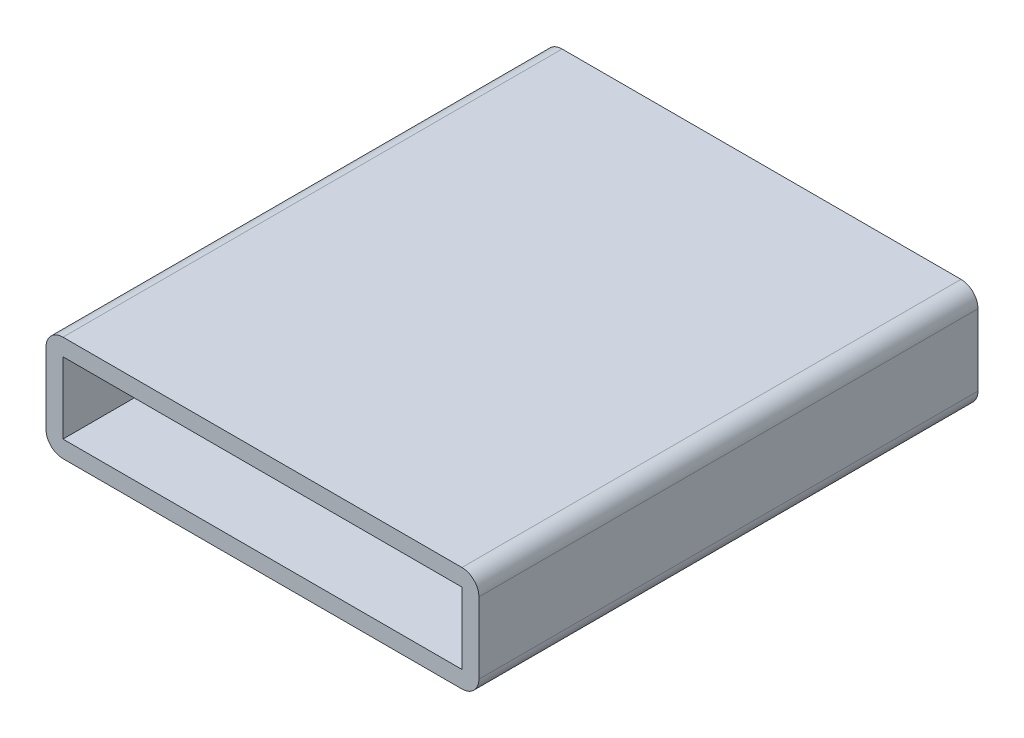
ISO-10303-21;
HEADER;
FILE_DESCRIPTION(('STEP AP214'),'2;1');
FILE_NAME('part.step','',(''),(''),'','','');
FILE_SCHEMA(('AUTOMOTIVE_DESIGN { 1 0 10303 214 1 1 1 1 }'));
ENDSEC;
DATA;
#1=APPLICATION_CONTEXT('core data for automotive mechanical design processes');
#2=APPLICATION_PROTOCOL_DEFINITION('international standard','automotive_design',2000,#1);
#3=PRODUCT_CONTEXT('',#1,'mechanical');
#4=PRODUCT('Part','Part','',(#3));
#5=PRODUCT_RELATED_PRODUCT_CATEGORY('part','',(#4));
#6=PRODUCT_DEFINITION_FORMATION('','',#4);
#7=PRODUCT_DEFINITION_CONTEXT('part definition',#1,'design');
#8=PRODUCT_DEFINITION('design','',#6,#7);
#9=PRODUCT_DEFINITION_SHAPE('','',#8);
#10=(LENGTH_UNIT() NAMED_UNIT(*) SI_UNIT(.MILLI.,.METRE.));
#11=(NAMED_UNIT(*) PLANE_ANGLE_UNIT() SI_UNIT($,.RADIAN.));
#12=(NAMED_UNIT(*) SI_UNIT($,.STERADIAN.) SOLID_ANGLE_UNIT());
#13=UNCERTAINTY_MEASURE_WITH_UNIT(LENGTH_MEASURE(1.E-05),#10,'distance_accuracy_value','');
#14=(GEOMETRIC_REPRESENTATION_CONTEXT(3) GLOBAL_UNCERTAINTY_ASSIGNED_CONTEXT((#13)) GLOBAL_UNIT_ASSIGNED_CONTEXT((#10,
#11,#12)) REPRESENTATION_CONTEXT('',''));
#15=CARTESIAN_POINT('',(0.,0.,0.));
#16=DIRECTION('',(0.,0.,1.));
#17=DIRECTION('',(1.,0.,0.));
#18=AXIS2_PLACEMENT_3D('',#15,#16,#17);
#19=CARTESIAN_POINT('',(14.9225,2.667,-37.338));
#20=DIRECTION('',(1.,0.,0.));
#21=DIRECTION('',(0.,0.,-1.));
#22=AXIS2_PLACEMENT_3D('',#19,#20,#21);
#23=PLANE('',#22);
#24=DIRECTION('',(0.,-1.,0.));
#25=VECTOR('',#24,1.);
#26=CARTESIAN_POINT('',(14.9225,2.667,-36.068));
#27=LINE('',#26,#25);
#28=CARTESIAN_POINT('',(14.9225,2.667,-36.068));
#29=VERTEX_POINT('',#28);
#30=CARTESIAN_POINT('',(14.9225,-2.667,-36.068));
#31=VERTEX_POINT('',#30);
#32=EDGE_CURVE('E50',#29,#31,#27,.T.);
#33=ORIENTED_EDGE('',*,*,#32,.T.);
#34=DIRECTION('',(0.,0.,1.));
#35=VECTOR('',#34,1.);
#36=CARTESIAN_POINT('',(14.9225,-2.667,-37.338));
#37=LINE('',#36,#35);
#38=CARTESIAN_POINT('',(14.9225,-2.667,0.));
#39=VERTEX_POINT('',#38);
#40=EDGE_CURVE('E267',#31,#39,#37,.T.);
#41=ORIENTED_EDGE('',*,*,#40,.T.);
#42=DIRECTION('',(0.,1.,0.));
#43=VECTOR('',#42,1.);
#44=CARTESIAN_POINT('',(14.9225,2.667,0.));
#45=LINE('',#44,#43);
#46=CARTESIAN_POINT('',(14.9225,2.667,0.));
#47=VERTEX_POINT('',#46);
#48=EDGE_CURVE('E254',#39,#47,#45,.T.);
#49=ORIENTED_EDGE('',*,*,#48,.T.);
#50=DIRECTION('',(0.,0.,1.));
#51=VECTOR('',#50,1.);
#52=CARTESIAN_POINT('',(14.9225,2.667,-37.338));
#53=LINE('',#52,#51);
#54=EDGE_CURVE('E266',#29,#47,#53,.T.);
#55=ORIENTED_EDGE('',*,*,#54,.F.);
#56=EDGE_LOOP('',(#33,#41,#49,#55));
#57=FACE_BOUND('',#56,.T.);
#58=ADVANCED_FACE('F35',(#57),#23,.F.);
#59=CARTESIAN_POINT('',(-14.9225,-2.667,-37.338));
#60=DIRECTION('',(0.,-1.,0.));
#61=DIRECTION('',(0.,0.,-1.));
#62=AXIS2_PLACEMENT_3D('',#59,#60,#61);
#63=PLANE('',#62);
#64=DIRECTION('',(-1.,0.,0.));
#65=VECTOR('',#64,1.);
#66=CARTESIAN_POINT('',(14.9225,-2.667,-36.068));
#67=LINE('',#66,#65);
#68=CARTESIAN_POINT('',(-14.9225,-2.667,-36.068));
#69=VERTEX_POINT('',#68);
#70=EDGE_CURVE('E57',#31,#69,#67,.T.);
#71=ORIENTED_EDGE('',*,*,#70,.T.);
#72=DIRECTION('',(0.,0.,1.));
#73=VECTOR('',#72,1.);
#74=CARTESIAN_POINT('',(-14.9225,-2.667,-37.338));
#75=LINE('',#74,#73);
#76=CARTESIAN_POINT('',(-14.9225,-2.667,0.));
#77=VERTEX_POINT('',#76);
#78=EDGE_CURVE('E270',#69,#77,#75,.T.);
#79=ORIENTED_EDGE('',*,*,#78,.T.);
#80=DIRECTION('',(1.,0.,0.));
#81=VECTOR('',#80,1.);
#82=CARTESIAN_POINT('',(-14.9225,-2.667,0.));
#83=LINE('',#82,#81);
#84=EDGE_CURVE('E263',#77,#39,#83,.T.);
#85=ORIENTED_EDGE('',*,*,#84,.T.);
#86=ORIENTED_EDGE('',*,*,#40,.F.);
#87=EDGE_LOOP('',(#71,#79,#85,#86));
#88=FACE_BOUND('',#87,.T.);
#89=ADVANCED_FACE('F376',(#88),#63,.F.);
#90=CARTESIAN_POINT('',(-14.9225,2.667,-37.338));
#91=DIRECTION('',(-1.,0.,0.));
#92=DIRECTION('',(0.,0.,1.));
#93=AXIS2_PLACEMENT_3D('',#90,#91,#92);
#94=PLANE('',#93);
#95=DIRECTION('',(0.,1.,0.));
#96=VECTOR('',#95,1.);
#97=CARTESIAN_POINT('',(-14.9225,2.667,-36.068));
#98=LINE('',#97,#96);
#99=CARTESIAN_POINT('',(-14.9225,2.667,-36.068));
#100=VERTEX_POINT('',#99);
#101=EDGE_CURVE('E236',#69,#100,#98,.T.);
#102=ORIENTED_EDGE('',*,*,#101,.T.);
#103=DIRECTION('',(0.,0.,1.));
#104=VECTOR('',#103,1.);
#105=CARTESIAN_POINT('',(-14.9225,2.667,-37.338));
#106=LINE('',#105,#104);
#107=CARTESIAN_POINT('',(-14.9225,2.667,0.));
#108=VERTEX_POINT('',#107);
#109=EDGE_CURVE('E272',#100,#108,#106,.T.);
#110=ORIENTED_EDGE('',*,*,#109,.T.);
#111=DIRECTION('',(0.,-1.,0.));
#112=VECTOR('',#111,1.);
#113=CARTESIAN_POINT('',(-14.9225,2.667,0.));
#114=LINE('',#113,#112);
#115=EDGE_CURVE('E260',#108,#77,#114,.T.);
#116=ORIENTED_EDGE('',*,*,#115,.T.);
#117=ORIENTED_EDGE('',*,*,#78,.F.);
#118=EDGE_LOOP('',(#102,#110,#116,#117));
#119=FACE_BOUND('',#118,.T.);
#120=ADVANCED_FACE('F381',(#119),#94,.F.);
#121=CARTESIAN_POINT('',(-14.9225,2.667,-37.338));
#122=DIRECTION('',(0.,1.,0.));
#123=DIRECTION('',(0.,0.,1.));
#124=AXIS2_PLACEMENT_3D('',#121,#122,#123);
#125=PLANE('',#124);
#126=DIRECTION('',(1.,0.,0.));
#127=VECTOR('',#126,1.);
#128=CARTESIAN_POINT('',(14.9225,2.667,-36.068));
#129=LINE('',#128,#127);
#130=EDGE_CURVE('E250',#100,#29,#129,.T.);
#131=ORIENTED_EDGE('',*,*,#130,.T.);
#132=ORIENTED_EDGE('',*,*,#54,.T.);
#133=DIRECTION('',(-1.,0.,0.));
#134=VECTOR('',#133,1.);
#135=CARTESIAN_POINT('',(-14.9225,2.667,0.));
#136=LINE('',#135,#134);
#137=EDGE_CURVE('E257',#47,#108,#136,.T.);
#138=ORIENTED_EDGE('',*,*,#137,.T.);
#139=ORIENTED_EDGE('',*,*,#109,.F.);
#140=EDGE_LOOP('',(#131,#132,#138,#139));
#141=FACE_BOUND('',#140,.T.);
#142=ADVANCED_FACE('F385',(#141),#125,.F.);
#143=CARTESIAN_POINT('',(16.1925,3.937,-37.338));
#144=DIRECTION('',(1.,0.,0.));
#145=DIRECTION('',(0.,0.,-1.));
#146=AXIS2_PLACEMENT_3D('',#143,#144,#145);
#147=PLANE('',#146);
#148=DIRECTION('',(0.,1.,0.));
#149=VECTOR('',#148,1.);
#150=CARTESIAN_POINT('',(16.1925,3.937,0.));
#151=LINE('',#150,#149);
#152=CARTESIAN_POINT('',(16.1925,-2.667,0.));
#153=VERTEX_POINT('',#152);
#154=CARTESIAN_POINT('',(16.1925,2.667,0.));
#155=VERTEX_POINT('',#154);
#156=EDGE_CURVE('E269',#153,#155,#151,.T.);
#157=ORIENTED_EDGE('',*,*,#156,.F.);
#158=DIRECTION('',(0.,0.,1.));
#159=VECTOR('',#158,1.);
#160=CARTESIAN_POINT('',(16.1925,-2.667,-37.338));
#161=LINE('',#160,#159);
#162=CARTESIAN_POINT('',(16.1925,-2.667,-37.338));
#163=VERTEX_POINT('',#162);
#164=EDGE_CURVE('E314',#153,#163,#161,.F.);
#165=ORIENTED_EDGE('',*,*,#164,.T.);
#166=DIRECTION('',(0.,1.,0.));
#167=VECTOR('',#166,1.);
#168=CARTESIAN_POINT('',(16.1925,3.937,-37.338));
#169=LINE('',#168,#167);
#170=CARTESIAN_POINT('',(16.1925,2.667,-37.338));
#171=VERTEX_POINT('',#170);
#172=EDGE_CURVE('E275',#163,#171,#169,.T.);
#173=ORIENTED_EDGE('',*,*,#172,.T.);
#174=DIRECTION('',(0.,0.,1.));
#175=VECTOR('',#174,1.);
#176=CARTESIAN_POINT('',(16.1925,2.667,-37.338));
#177=LINE('',#176,#175);
#178=EDGE_CURVE('E311',#171,#155,#177,.T.);
#179=ORIENTED_EDGE('',*,*,#178,.T.);
#180=EDGE_LOOP('',(#157,#165,#173,#179));
#181=FACE_BOUND('',#180,.T.);
#182=ADVANCED_FACE('F346',(#181),#147,.T.);
#183=CARTESIAN_POINT('',(-16.1925,-3.937,-37.338));
#184=DIRECTION('',(0.,-1.,0.));
#185=DIRECTION('',(0.,0.,-1.));
#186=AXIS2_PLACEMENT_3D('',#183,#184,#185);
#187=PLANE('',#186);
#188=DIRECTION('',(1.,0.,0.));
#189=VECTOR('',#188,1.);
#190=CARTESIAN_POINT('',(-16.1925,-3.937,-37.338));
#191=LINE('',#190,#189);
#192=CARTESIAN_POINT('',(-14.9225,-3.937,-37.338));
#193=VERTEX_POINT('',#192);
#194=CARTESIAN_POINT('',(14.9225,-3.937,-37.338));
#195=VERTEX_POINT('',#194);
#196=EDGE_CURVE('E285',#193,#195,#191,.T.);
#197=ORIENTED_EDGE('',*,*,#196,.T.);
#198=DIRECTION('',(0.,0.,1.));
#199=VECTOR('',#198,1.);
#200=CARTESIAN_POINT('',(14.9225,-3.937,-37.338));
#201=LINE('',#200,#199);
#202=CARTESIAN_POINT('',(14.9225,-3.937,0.));
#203=VERTEX_POINT('',#202);
#204=EDGE_CURVE('E300',#195,#203,#201,.T.);
#205=ORIENTED_EDGE('',*,*,#204,.T.);
#206=DIRECTION('',(1.,0.,0.));
#207=VECTOR('',#206,1.);
#208=CARTESIAN_POINT('',(-16.1925,-3.937,0.));
#209=LINE('',#208,#207);
#210=CARTESIAN_POINT('',(-14.9225,-3.937,0.));
#211=VERTEX_POINT('',#210);
#212=EDGE_CURVE('E279',#211,#203,#209,.T.);
#213=ORIENTED_EDGE('',*,*,#212,.F.);
#214=DIRECTION('',(0.,0.,1.));
#215=VECTOR('',#214,1.);
#216=CARTESIAN_POINT('',(-14.9225,-3.937,-37.338));
#217=LINE('',#216,#215);
#218=EDGE_CURVE('E288',#211,#193,#217,.F.);
#219=ORIENTED_EDGE('',*,*,#218,.T.);
#220=EDGE_LOOP('',(#197,#205,#213,#219));
#221=FACE_BOUND('',#220,.T.);
#222=ADVANCED_FACE('F359',(#221),#187,.T.);
#223=CARTESIAN_POINT('',(-16.1925,3.937,-37.338));
#224=DIRECTION('',(-1.,0.,0.));
#225=DIRECTION('',(0.,0.,1.));
#226=AXIS2_PLACEMENT_3D('',#223,#224,#225);
#227=PLANE('',#226);
#228=DIRECTION('',(0.,-1.,0.));
#229=VECTOR('',#228,1.);
#230=CARTESIAN_POINT('',(-16.1925,3.937,-37.338));
#231=LINE('',#230,#229);
#232=CARTESIAN_POINT('',(-16.1925,2.667,-37.338));
#233=VERTEX_POINT('',#232);
#234=CARTESIAN_POINT('',(-16.1925,-2.667,-37.338));
#235=VERTEX_POINT('',#234);
#236=EDGE_CURVE('E282',#233,#235,#231,.T.);
#237=ORIENTED_EDGE('',*,*,#236,.T.);
#238=DIRECTION('',(0.,0.,1.));
#239=VECTOR('',#238,1.);
#240=CARTESIAN_POINT('',(-16.1925,-2.667,-37.338));
#241=LINE('',#240,#239);
#242=CARTESIAN_POINT('',(-16.1925,-2.667,0.));
#243=VERTEX_POINT('',#242);
#244=EDGE_CURVE('E326',#235,#243,#241,.T.);
#245=ORIENTED_EDGE('',*,*,#244,.T.);
#246=DIRECTION('',(0.,-1.,0.));
#247=VECTOR('',#246,1.);
#248=CARTESIAN_POINT('',(-16.1925,3.937,0.));
#249=LINE('',#248,#247);
#250=CARTESIAN_POINT('',(-16.1925,2.667,0.));
#251=VERTEX_POINT('',#250);
#252=EDGE_CURVE('E294',#251,#243,#249,.T.);
#253=ORIENTED_EDGE('',*,*,#252,.F.);
#254=DIRECTION('',(0.,0.,1.));
#255=VECTOR('',#254,1.);
#256=CARTESIAN_POINT('',(-16.1925,2.667,-37.338));
#257=LINE('',#256,#255);
#258=EDGE_CURVE('E324',#251,#233,#257,.F.);
#259=ORIENTED_EDGE('',*,*,#258,.T.);
#260=EDGE_LOOP('',(#237,#245,#253,#259));
#261=FACE_BOUND('',#260,.T.);
#262=ADVANCED_FACE('F366',(#261),#227,.T.);
#263=CARTESIAN_POINT('',(-16.1925,3.937,-37.338));
#264=DIRECTION('',(0.,1.,0.));
#265=DIRECTION('',(0.,0.,1.));
#266=AXIS2_PLACEMENT_3D('',#263,#264,#265);
#267=PLANE('',#266);
#268=DIRECTION('',(-1.,0.,0.));
#269=VECTOR('',#268,1.);
#270=CARTESIAN_POINT('',(-16.1925,3.937,0.));
#271=LINE('',#270,#269);
#272=CARTESIAN_POINT('',(14.9225,3.937,0.));
#273=VERTEX_POINT('',#272);
#274=CARTESIAN_POINT('',(-14.9225,3.937,0.));
#275=VERTEX_POINT('',#274);
#276=EDGE_CURVE('E291',#273,#275,#271,.T.);
#277=ORIENTED_EDGE('',*,*,#276,.F.);
#278=DIRECTION('',(0.,0.,1.));
#279=VECTOR('',#278,1.);
#280=CARTESIAN_POINT('',(14.9225,3.937,-37.338));
#281=LINE('',#280,#279);
#282=CARTESIAN_POINT('',(14.9225,3.937,-37.338));
#283=VERTEX_POINT('',#282);
#284=EDGE_CURVE('E11',#273,#283,#281,.F.);
#285=ORIENTED_EDGE('',*,*,#284,.T.);
#286=DIRECTION('',(-1.,0.,0.));
#287=VECTOR('',#286,1.);
#288=CARTESIAN_POINT('',(-16.1925,3.937,-37.338));
#289=LINE('',#288,#287);
#290=CARTESIAN_POINT('',(-14.9225,3.937,-37.338));
#291=VERTEX_POINT('',#290);
#292=EDGE_CURVE('E278',#283,#291,#289,.T.);
#293=ORIENTED_EDGE('',*,*,#292,.T.);
#294=DIRECTION('',(0.,0.,1.));
#295=VECTOR('',#294,1.);
#296=CARTESIAN_POINT('',(-14.9225,3.937,-37.338));
#297=LINE('',#296,#295);
#298=EDGE_CURVE('E43',#291,#275,#297,.T.);
#299=ORIENTED_EDGE('',*,*,#298,.T.);
#300=EDGE_LOOP('',(#277,#285,#293,#299));
#301=FACE_BOUND('',#300,.T.);
#302=ADVANCED_FACE('F332',(#301),#267,.T.);
#303=CARTESIAN_POINT('',(0.,0.,-37.338));
#304=DIRECTION('',(0.,0.,1.));
#305=DIRECTION('',(1.,0.,0.));
#306=AXIS2_PLACEMENT_3D('',#303,#304,#305);
#307=PLANE('',#306);
#308=ORIENTED_EDGE('',*,*,#172,.F.);
#309=CARTESIAN_POINT('',(14.9225,-2.667,-37.338));
#310=DIRECTION('',(0.,0.,1.));
#311=DIRECTION('',(1.,0.,0.));
#312=AXIS2_PLACEMENT_3D('',#309,#310,#311);
#313=CIRCLE('',#312,1.27);
#314=EDGE_CURVE('E322',#163,#195,#313,.F.);
#315=ORIENTED_EDGE('',*,*,#314,.T.);
#316=ORIENTED_EDGE('',*,*,#196,.F.);
#317=CARTESIAN_POINT('',(-14.9225,-2.667,-37.338));
#318=DIRECTION('',(0.,0.,1.));
#319=DIRECTION('',(1.,0.,0.));
#320=AXIS2_PLACEMENT_3D('',#317,#318,#319);
#321=CIRCLE('',#320,1.27);
#322=EDGE_CURVE('E320',#193,#235,#321,.F.);
#323=ORIENTED_EDGE('',*,*,#322,.T.);
#324=ORIENTED_EDGE('',*,*,#236,.F.);
#325=CARTESIAN_POINT('',(-14.9225,2.667,-37.338));
#326=DIRECTION('',(0.,0.,1.));
#327=DIRECTION('',(1.,0.,0.));
#328=AXIS2_PLACEMENT_3D('',#325,#326,#327);
#329=CIRCLE('',#328,1.27);
#330=EDGE_CURVE('E316',#233,#291,#329,.F.);
#331=ORIENTED_EDGE('',*,*,#330,.T.);
#332=ORIENTED_EDGE('',*,*,#292,.F.);
#333=CARTESIAN_POINT('',(14.9225,2.667,-37.338));
#334=DIRECTION('',(0.,0.,1.));
#335=DIRECTION('',(1.,0.,0.));
#336=AXIS2_PLACEMENT_3D('',#333,#334,#335);
#337=CIRCLE('',#336,1.27);
#338=EDGE_CURVE('E318',#283,#171,#337,.F.);
#339=ORIENTED_EDGE('',*,*,#338,.T.);
#340=EDGE_LOOP('',(#308,#315,#316,#323,#324,#331,#332,#339));
#341=FACE_BOUND('',#340,.T.);
#342=CARTESIAN_POINT('',(-2.794,1.524,-37.338));
#343=DIRECTION('',(0.,0.,-1.));
#344=DIRECTION('',(1.,0.,0.));
#345=AXIS2_PLACEMENT_3D('',#342,#343,#344);
#346=CIRCLE('',#345,1.016);
#347=CARTESIAN_POINT('',(-3.81,1.524,-37.338));
#348=VERTEX_POINT('',#347);
#349=CARTESIAN_POINT('',(-2.794,2.54,-37.338));
#350=VERTEX_POINT('',#349);
#351=EDGE_CURVE('E179',#348,#350,#346,.T.);
#352=ORIENTED_EDGE('',*,*,#351,.F.);
#353=DIRECTION('',(0.,1.,0.));
#354=VECTOR('',#353,1.);
#355=CARTESIAN_POINT('',(-3.81,1.524,-37.338));
#356=LINE('',#355,#354);
#357=CARTESIAN_POINT('',(-3.81,-1.524,-37.338));
#358=VERTEX_POINT('',#357);
#359=EDGE_CURVE('E198',#358,#348,#356,.T.);
#360=ORIENTED_EDGE('',*,*,#359,.F.);
#361=CARTESIAN_POINT('',(-2.794,-1.524,-37.338));
#362=DIRECTION('',(0.,0.,-1.));
#363=DIRECTION('',(-1.,0.,0.));
#364=AXIS2_PLACEMENT_3D('',#361,#362,#363);
#365=CIRCLE('',#364,1.016);
#366=CARTESIAN_POINT('',(-2.794,-2.54,-37.338));
#367=VERTEX_POINT('',#366);
#368=EDGE_CURVE('E201',#367,#358,#365,.T.);
#369=ORIENTED_EDGE('',*,*,#368,.F.);
#370=DIRECTION('',(-1.,0.,0.));
#371=VECTOR('',#370,1.);
#372=CARTESIAN_POINT('',(2.794,-2.54,-37.338));
#373=LINE('',#372,#371);
#374=CARTESIAN_POINT('',(2.794,-2.54,-37.338));
#375=VERTEX_POINT('',#374);
#376=EDGE_CURVE('E229',#375,#367,#373,.T.);
#377=ORIENTED_EDGE('',*,*,#376,.F.);
#378=CARTESIAN_POINT('',(2.794,-1.524,-37.338));
#379=DIRECTION('',(0.,0.,-1.));
#380=DIRECTION('',(-1.,0.,0.));
#381=AXIS2_PLACEMENT_3D('',#378,#379,#380);
#382=CIRCLE('',#381,1.016);
#383=CARTESIAN_POINT('',(3.81,-1.524,-37.338));
#384=VERTEX_POINT('',#383);
#385=EDGE_CURVE('E226',#384,#375,#382,.T.);
#386=ORIENTED_EDGE('',*,*,#385,.F.);
#387=DIRECTION('',(0.,-1.,0.));
#388=VECTOR('',#387,1.);
#389=CARTESIAN_POINT('',(3.81,1.524,-37.338));
#390=LINE('',#389,#388);
#391=CARTESIAN_POINT('',(3.81,1.524,-37.338));
#392=VERTEX_POINT('',#391);
#393=EDGE_CURVE('E223',#392,#384,#390,.T.);
#394=ORIENTED_EDGE('',*,*,#393,.F.);
#395=CARTESIAN_POINT('',(2.794,1.524,-37.338));
#396=DIRECTION('',(0.,0.,-1.));
#397=DIRECTION('',(-1.,0.,0.));
#398=AXIS2_PLACEMENT_3D('',#395,#396,#397);
#399=CIRCLE('',#398,1.016);
#400=CARTESIAN_POINT('',(2.794,2.54,-37.338));
#401=VERTEX_POINT('',#400);
#402=EDGE_CURVE('E220',#401,#392,#399,.T.);
#403=ORIENTED_EDGE('',*,*,#402,.F.);
#404=DIRECTION('',(1.,0.,0.));
#405=VECTOR('',#404,1.);
#406=CARTESIAN_POINT('',(2.794,2.54,-37.338));
#407=LINE('',#406,#405);
#408=EDGE_CURVE('E218',#350,#401,#407,.T.);
#409=ORIENTED_EDGE('',*,*,#408,.F.);
#410=EDGE_LOOP('',(#352,#360,#369,#377,#386,#394,#403,#409));
#411=FACE_BOUND('',#410,.T.);
#412=ADVANCED_FACE('F351',(#341,#411),#307,.F.);
#413=CARTESIAN_POINT('',(0.,0.,0.));
#414=DIRECTION('',(0.,0.,1.));
#415=DIRECTION('',(1.,0.,0.));
#416=AXIS2_PLACEMENT_3D('',#413,#414,#415);
#417=PLANE('',#416);
#418=ORIENTED_EDGE('',*,*,#48,.F.);
#419=ORIENTED_EDGE('',*,*,#84,.F.);
#420=ORIENTED_EDGE('',*,*,#115,.F.);
#421=ORIENTED_EDGE('',*,*,#137,.F.);
#422=EDGE_LOOP('',(#418,#419,#420,#421));
#423=FACE_BOUND('',#422,.T.);
#424=ORIENTED_EDGE('',*,*,#212,.T.);
#425=CARTESIAN_POINT('',(14.9225,-2.667,0.));
#426=DIRECTION('',(0.,0.,1.));
#427=DIRECTION('',(1.,0.,0.));
#428=AXIS2_PLACEMENT_3D('',#425,#426,#427);
#429=CIRCLE('',#428,1.27);
#430=EDGE_CURVE('E309',#203,#153,#429,.T.);
#431=ORIENTED_EDGE('',*,*,#430,.T.);
#432=ORIENTED_EDGE('',*,*,#156,.T.);
#433=CARTESIAN_POINT('',(14.9225,2.667,0.));
#434=DIRECTION('',(0.,0.,1.));
#435=DIRECTION('',(1.,0.,0.));
#436=AXIS2_PLACEMENT_3D('',#433,#434,#435);
#437=CIRCLE('',#436,1.27);
#438=EDGE_CURVE('E305',#155,#273,#437,.T.);
#439=ORIENTED_EDGE('',*,*,#438,.T.);
#440=ORIENTED_EDGE('',*,*,#276,.T.);
#441=CARTESIAN_POINT('',(-14.9225,2.667,0.));
#442=DIRECTION('',(0.,0.,1.));
#443=DIRECTION('',(1.,0.,0.));
#444=AXIS2_PLACEMENT_3D('',#441,#442,#443);
#445=CIRCLE('',#444,1.27);
#446=EDGE_CURVE('E303',#275,#251,#445,.T.);
#447=ORIENTED_EDGE('',*,*,#446,.T.);
#448=ORIENTED_EDGE('',*,*,#252,.T.);
#449=CARTESIAN_POINT('',(-14.9225,-2.667,0.));
#450=DIRECTION('',(0.,0.,1.));
#451=DIRECTION('',(1.,0.,0.));
#452=AXIS2_PLACEMENT_3D('',#449,#450,#451);
#453=CIRCLE('',#452,1.27);
#454=EDGE_CURVE('E307',#243,#211,#453,.T.);
#455=ORIENTED_EDGE('',*,*,#454,.T.);
#456=EDGE_LOOP('',(#424,#431,#432,#439,#440,#447,#448,#455));
#457=FACE_BOUND('',#456,.T.);
#458=ADVANCED_FACE('F338',(#423,#457),#417,.T.);
#459=CARTESIAN_POINT('',(14.9225,-2.667,-37.338));
#460=DIRECTION('',(0.,0.,1.));
#461=DIRECTION('',(1.,0.,0.));
#462=AXIS2_PLACEMENT_3D('',#459,#460,#461);
#463=CYLINDRICAL_SURFACE('',#462,1.27);
#464=ORIENTED_EDGE('',*,*,#314,.F.);
#465=ORIENTED_EDGE('',*,*,#164,.F.);
#466=ORIENTED_EDGE('',*,*,#430,.F.);
#467=ORIENTED_EDGE('',*,*,#204,.F.);
#468=EDGE_LOOP('',(#464,#465,#466,#467));
#469=FACE_BOUND('',#468,.T.);
#470=ADVANCED_FACE('F356',(#469),#463,.T.);
#471=CARTESIAN_POINT('',(-14.9225,-2.667,-37.338));
#472=DIRECTION('',(0.,0.,1.));
#473=DIRECTION('',(1.,0.,0.));
#474=AXIS2_PLACEMENT_3D('',#471,#472,#473);
#475=CYLINDRICAL_SURFACE('',#474,1.27);
#476=ORIENTED_EDGE('',*,*,#322,.F.);
#477=ORIENTED_EDGE('',*,*,#218,.F.);
#478=ORIENTED_EDGE('',*,*,#454,.F.);
#479=ORIENTED_EDGE('',*,*,#244,.F.);
#480=EDGE_LOOP('',(#476,#477,#478,#479));
#481=FACE_BOUND('',#480,.T.);
#482=ADVANCED_FACE('F364',(#481),#475,.T.);
#483=CARTESIAN_POINT('',(14.9225,2.667,-37.338));
#484=DIRECTION('',(0.,0.,1.));
#485=DIRECTION('',(1.,0.,0.));
#486=AXIS2_PLACEMENT_3D('',#483,#484,#485);
#487=CYLINDRICAL_SURFACE('',#486,1.27);
#488=ORIENTED_EDGE('',*,*,#338,.F.);
#489=ORIENTED_EDGE('',*,*,#284,.F.);
#490=ORIENTED_EDGE('',*,*,#438,.F.);
#491=ORIENTED_EDGE('',*,*,#178,.F.);
#492=EDGE_LOOP('',(#488,#489,#490,#491));
#493=FACE_BOUND('',#492,.T.);
#494=ADVANCED_FACE('F344',(#493),#487,.T.);
#495=CARTESIAN_POINT('',(-14.9225,2.667,-37.338));
#496=DIRECTION('',(0.,0.,1.));
#497=DIRECTION('',(1.,0.,0.));
#498=AXIS2_PLACEMENT_3D('',#495,#496,#497);
#499=CYLINDRICAL_SURFACE('',#498,1.27);
#500=ORIENTED_EDGE('',*,*,#330,.F.);
#501=ORIENTED_EDGE('',*,*,#258,.F.);
#502=ORIENTED_EDGE('',*,*,#446,.F.);
#503=ORIENTED_EDGE('',*,*,#298,.F.);
#504=EDGE_LOOP('',(#500,#501,#502,#503));
#505=FACE_BOUND('',#504,.T.);
#506=ADVANCED_FACE('F37',(#505),#499,.T.);
#507=CARTESIAN_POINT('',(0.,0.,-36.068));
#508=DIRECTION('',(0.,0.,-1.));
#509=DIRECTION('',(-1.,0.,0.));
#510=AXIS2_PLACEMENT_3D('',#507,#508,#509);
#511=PLANE('',#510);
#512=DIRECTION('',(0.,1.,0.));
#513=VECTOR('',#512,1.);
#514=CARTESIAN_POINT('',(-3.81,1.524,-36.068));
#515=LINE('',#514,#513);
#516=CARTESIAN_POINT('',(-3.81,-1.524,-36.068));
#517=VERTEX_POINT('',#516);
#518=CARTESIAN_POINT('',(-3.81,1.524,-36.068));
#519=VERTEX_POINT('',#518);
#520=EDGE_CURVE('E184',#517,#519,#515,.T.);
#521=ORIENTED_EDGE('',*,*,#520,.T.);
#522=CARTESIAN_POINT('',(-2.794,1.524,-36.068));
#523=DIRECTION('',(0.,0.,-1.));
#524=DIRECTION('',(1.,0.,0.));
#525=AXIS2_PLACEMENT_3D('',#522,#523,#524);
#526=CIRCLE('',#525,1.016);
#527=CARTESIAN_POINT('',(-2.794,2.54,-36.068));
#528=VERTEX_POINT('',#527);
#529=EDGE_CURVE('E176',#519,#528,#526,.T.);
#530=ORIENTED_EDGE('',*,*,#529,.T.);
#531=DIRECTION('',(1.,0.,0.));
#532=VECTOR('',#531,1.);
#533=CARTESIAN_POINT('',(2.794,2.54,-36.068));
#534=LINE('',#533,#532);
#535=CARTESIAN_POINT('',(2.794,2.54,-36.068));
#536=VERTEX_POINT('',#535);
#537=EDGE_CURVE('E188',#528,#536,#534,.T.);
#538=ORIENTED_EDGE('',*,*,#537,.T.);
#539=CARTESIAN_POINT('',(2.794,1.524,-36.068));
#540=DIRECTION('',(0.,0.,-1.));
#541=DIRECTION('',(-1.,0.,0.));
#542=AXIS2_PLACEMENT_3D('',#539,#540,#541);
#543=CIRCLE('',#542,1.016);
#544=CARTESIAN_POINT('',(3.81,1.524,-36.068));
#545=VERTEX_POINT('',#544);
#546=EDGE_CURVE('E192',#536,#545,#543,.T.);
#547=ORIENTED_EDGE('',*,*,#546,.T.);
#548=DIRECTION('',(0.,-1.,0.));
#549=VECTOR('',#548,1.);
#550=CARTESIAN_POINT('',(3.81,1.524,-36.068));
#551=LINE('',#550,#549);
#552=CARTESIAN_POINT('',(3.81,-1.524,-36.068));
#553=VERTEX_POINT('',#552);
#554=EDGE_CURVE('E205',#545,#553,#551,.T.);
#555=ORIENTED_EDGE('',*,*,#554,.T.);
#556=CARTESIAN_POINT('',(2.794,-1.524,-36.068));
#557=DIRECTION('',(0.,0.,-1.));
#558=DIRECTION('',(-1.,0.,0.));
#559=AXIS2_PLACEMENT_3D('',#556,#557,#558);
#560=CIRCLE('',#559,1.016);
#561=CARTESIAN_POINT('',(2.794,-2.54,-36.068));
#562=VERTEX_POINT('',#561);
#563=EDGE_CURVE('E208',#553,#562,#560,.T.);
#564=ORIENTED_EDGE('',*,*,#563,.T.);
#565=DIRECTION('',(-1.,0.,0.));
#566=VECTOR('',#565,1.);
#567=CARTESIAN_POINT('',(2.794,-2.54,-36.068));
#568=LINE('',#567,#566);
#569=CARTESIAN_POINT('',(-2.794,-2.54,-36.068));
#570=VERTEX_POINT('',#569);
#571=EDGE_CURVE('E211',#562,#570,#568,.T.);
#572=ORIENTED_EDGE('',*,*,#571,.T.);
#573=CARTESIAN_POINT('',(-2.794,-1.524,-36.068));
#574=DIRECTION('',(0.,0.,-1.));
#575=DIRECTION('',(-1.,0.,0.));
#576=AXIS2_PLACEMENT_3D('',#573,#574,#575);
#577=CIRCLE('',#576,1.016);
#578=EDGE_CURVE('E214',#570,#517,#577,.T.);
#579=ORIENTED_EDGE('',*,*,#578,.T.);
#580=EDGE_LOOP('',(#521,#530,#538,#547,#555,#564,#572,#579));
#581=FACE_BOUND('',#580,.T.);
#582=ORIENTED_EDGE('',*,*,#101,.F.);
#583=ORIENTED_EDGE('',*,*,#70,.F.);
#584=ORIENTED_EDGE('',*,*,#32,.F.);
#585=ORIENTED_EDGE('',*,*,#130,.F.);
#586=EDGE_LOOP('',(#582,#583,#584,#585));
#587=FACE_BOUND('',#586,.T.);
#588=ADVANCED_FACE('F194',(#581,#587),#511,.F.);
#589=CARTESIAN_POINT('',(-2.794,1.524,-36.068));
#590=DIRECTION('',(0.,0.,-1.));
#591=DIRECTION('',(-1.,0.,0.));
#592=AXIS2_PLACEMENT_3D('',#589,#590,#591);
#593=CYLINDRICAL_SURFACE('',#592,1.016);
#594=ORIENTED_EDGE('',*,*,#351,.T.);
#595=DIRECTION('',(0.,0.,-1.));
#596=VECTOR('',#595,1.);
#597=CARTESIAN_POINT('',(-2.794,2.54,-36.068));
#598=LINE('',#597,#596);
#599=EDGE_CURVE('E172',#528,#350,#598,.T.);
#600=ORIENTED_EDGE('',*,*,#599,.F.);
#601=ORIENTED_EDGE('',*,*,#529,.F.);
#602=DIRECTION('',(0.,0.,-1.));
#603=VECTOR('',#602,1.);
#604=CARTESIAN_POINT('',(-3.81,1.524,-36.068));
#605=LINE('',#604,#603);
#606=EDGE_CURVE('E234',#519,#348,#605,.T.);
#607=ORIENTED_EDGE('',*,*,#606,.T.);
#608=EDGE_LOOP('',(#594,#600,#601,#607));
#609=FACE_BOUND('',#608,.T.);
#610=ADVANCED_FACE('F174',(#609),#593,.F.);
#611=CARTESIAN_POINT('',(-3.81,1.524,-36.068));
#612=DIRECTION('',(-1.,0.,0.));
#613=DIRECTION('',(0.,0.,1.));
#614=AXIS2_PLACEMENT_3D('',#611,#612,#613);
#615=PLANE('',#614);
#616=ORIENTED_EDGE('',*,*,#359,.T.);
#617=ORIENTED_EDGE('',*,*,#606,.F.);
#618=ORIENTED_EDGE('',*,*,#520,.F.);
#619=DIRECTION('',(0.,0.,-1.));
#620=VECTOR('',#619,1.);
#621=CARTESIAN_POINT('',(-3.81,-1.524,-36.068));
#622=LINE('',#621,#620);
#623=EDGE_CURVE('E237',#517,#358,#622,.T.);
#624=ORIENTED_EDGE('',*,*,#623,.T.);
#625=EDGE_LOOP('',(#616,#617,#618,#624));
#626=FACE_BOUND('',#625,.T.);
#627=ADVANCED_FACE('F463',(#626),#615,.F.);
#628=CARTESIAN_POINT('',(-2.794,-1.524,-36.068));
#629=DIRECTION('',(0.,0.,-1.));
#630=DIRECTION('',(-1.,0.,0.));
#631=AXIS2_PLACEMENT_3D('',#628,#629,#630);
#632=CYLINDRICAL_SURFACE('',#631,1.016);
#633=ORIENTED_EDGE('',*,*,#368,.T.);
#634=ORIENTED_EDGE('',*,*,#623,.F.);
#635=ORIENTED_EDGE('',*,*,#578,.F.);
#636=DIRECTION('',(0.,0.,-1.));
#637=VECTOR('',#636,1.);
#638=CARTESIAN_POINT('',(-2.794,-2.54,-36.068));
#639=LINE('',#638,#637);
#640=EDGE_CURVE('E239',#570,#367,#639,.T.);
#641=ORIENTED_EDGE('',*,*,#640,.T.);
#642=EDGE_LOOP('',(#633,#634,#635,#641));
#643=FACE_BOUND('',#642,.T.);
#644=ADVANCED_FACE('F472',(#643),#632,.F.);
#645=CARTESIAN_POINT('',(2.794,-2.54,-36.068));
#646=DIRECTION('',(0.,-1.,0.));
#647=DIRECTION('',(1.,0.,0.));
#648=AXIS2_PLACEMENT_3D('',#645,#646,#647);
#649=PLANE('',#648);
#650=ORIENTED_EDGE('',*,*,#376,.T.);
#651=ORIENTED_EDGE('',*,*,#640,.F.);
#652=ORIENTED_EDGE('',*,*,#571,.F.);
#653=DIRECTION('',(0.,0.,-1.));
#654=VECTOR('',#653,1.);
#655=CARTESIAN_POINT('',(2.794,-2.54,-36.068));
#656=LINE('',#655,#654);
#657=EDGE_CURVE('E241',#562,#375,#656,.T.);
#658=ORIENTED_EDGE('',*,*,#657,.T.);
#659=EDGE_LOOP('',(#650,#651,#652,#658));
#660=FACE_BOUND('',#659,.T.);
#661=ADVANCED_FACE('F482',(#660),#649,.F.);
#662=CARTESIAN_POINT('',(2.794,-1.524,-36.068));
#663=DIRECTION('',(0.,0.,-1.));
#664=DIRECTION('',(-1.,0.,0.));
#665=AXIS2_PLACEMENT_3D('',#662,#663,#664);
#666=CYLINDRICAL_SURFACE('',#665,1.016);
#667=ORIENTED_EDGE('',*,*,#385,.T.);
#668=ORIENTED_EDGE('',*,*,#657,.F.);
#669=ORIENTED_EDGE('',*,*,#563,.F.);
#670=DIRECTION('',(0.,0.,-1.));
#671=VECTOR('',#670,1.);
#672=CARTESIAN_POINT('',(3.81,-1.524,-36.068));
#673=LINE('',#672,#671);
#674=EDGE_CURVE('E243',#553,#384,#673,.T.);
#675=ORIENTED_EDGE('',*,*,#674,.T.);
#676=EDGE_LOOP('',(#667,#668,#669,#675));
#677=FACE_BOUND('',#676,.T.);
#678=ADVANCED_FACE('F492',(#677),#666,.F.);
#679=CARTESIAN_POINT('',(3.81,1.524,-36.068));
#680=DIRECTION('',(1.,0.,0.));
#681=DIRECTION('',(0.,1.,0.));
#682=AXIS2_PLACEMENT_3D('',#679,#680,#681);
#683=PLANE('',#682);
#684=ORIENTED_EDGE('',*,*,#393,.T.);
#685=ORIENTED_EDGE('',*,*,#674,.F.);
#686=ORIENTED_EDGE('',*,*,#554,.F.);
#687=DIRECTION('',(0.,0.,-1.));
#688=VECTOR('',#687,1.);
#689=CARTESIAN_POINT('',(3.81,1.524,-36.068));
#690=LINE('',#689,#688);
#691=EDGE_CURVE('E245',#545,#392,#690,.T.);
#692=ORIENTED_EDGE('',*,*,#691,.T.);
#693=EDGE_LOOP('',(#684,#685,#686,#692));
#694=FACE_BOUND('',#693,.T.);
#695=ADVANCED_FACE('F502',(#694),#683,.F.);
#696=CARTESIAN_POINT('',(2.794,1.524,-36.068));
#697=DIRECTION('',(0.,0.,-1.));
#698=DIRECTION('',(-1.,0.,0.));
#699=AXIS2_PLACEMENT_3D('',#696,#697,#698);
#700=CYLINDRICAL_SURFACE('',#699,1.016);
#701=ORIENTED_EDGE('',*,*,#402,.T.);
#702=ORIENTED_EDGE('',*,*,#691,.F.);
#703=ORIENTED_EDGE('',*,*,#546,.F.);
#704=DIRECTION('',(0.,0.,-1.));
#705=VECTOR('',#704,1.);
#706=CARTESIAN_POINT('',(2.794,2.54,-36.068));
#707=LINE('',#706,#705);
#708=EDGE_CURVE('E183',#536,#401,#707,.T.);
#709=ORIENTED_EDGE('',*,*,#708,.T.);
#710=EDGE_LOOP('',(#701,#702,#703,#709));
#711=FACE_BOUND('',#710,.T.);
#712=ADVANCED_FACE('F512',(#711),#700,.F.);
#713=CARTESIAN_POINT('',(2.794,2.54,-36.068));
#714=DIRECTION('',(0.,1.,0.));
#715=DIRECTION('',(0.,0.,1.));
#716=AXIS2_PLACEMENT_3D('',#713,#714,#715);
#717=PLANE('',#716);
#718=ORIENTED_EDGE('',*,*,#408,.T.);
#719=ORIENTED_EDGE('',*,*,#708,.F.);
#720=ORIENTED_EDGE('',*,*,#537,.F.);
#721=ORIENTED_EDGE('',*,*,#599,.T.);
#722=EDGE_LOOP('',(#718,#719,#720,#721));
#723=FACE_BOUND('',#722,.T.);
#724=ADVANCED_FACE('F189',(#723),#717,.F.);
#725=CLOSED_SHELL('',(#58,#89,#120,#142,#182,#222,#262,#302,#412,#458,#470,#482,#494,#506,#588,
#610,#627,#644,#661,#678,#695,#712,#724));
#726=MANIFOLD_SOLID_BREP('B2',#725);
#727=ADVANCED_BREP_SHAPE_REPRESENTATION('',(#18,#726),#14);
#728=SHAPE_DEFINITION_REPRESENTATION(#9,#727);
ENDSEC;
END-ISO-10303-21;
